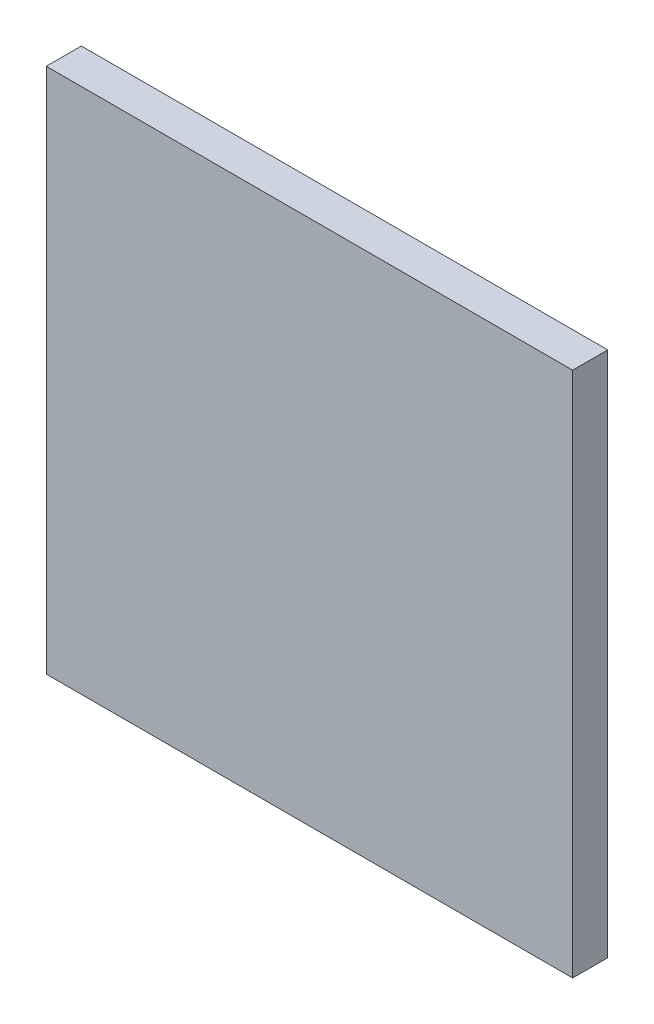
ISO-10303-21;
HEADER;
FILE_DESCRIPTION(('STEP AP214'),'2;1');
FILE_NAME('part.step','',(''),(''),'','','');
FILE_SCHEMA(('AUTOMOTIVE_DESIGN { 1 0 10303 214 1 1 1 1 }'));
ENDSEC;
DATA;
#1=APPLICATION_CONTEXT('core data for automotive mechanical design processes');
#2=APPLICATION_PROTOCOL_DEFINITION('international standard','automotive_design',2000,#1);
#3=PRODUCT_CONTEXT('',#1,'mechanical');
#4=PRODUCT('Part','Part','',(#3));
#5=PRODUCT_RELATED_PRODUCT_CATEGORY('part','',(#4));
#6=PRODUCT_DEFINITION_FORMATION('','',#4);
#7=PRODUCT_DEFINITION_CONTEXT('part definition',#1,'design');
#8=PRODUCT_DEFINITION('design','',#6,#7);
#9=PRODUCT_DEFINITION_SHAPE('','',#8);
#10=(LENGTH_UNIT() NAMED_UNIT(*) SI_UNIT(.MILLI.,.METRE.));
#11=(NAMED_UNIT(*) PLANE_ANGLE_UNIT() SI_UNIT($,.RADIAN.));
#12=(NAMED_UNIT(*) SI_UNIT($,.STERADIAN.) SOLID_ANGLE_UNIT());
#13=UNCERTAINTY_MEASURE_WITH_UNIT(LENGTH_MEASURE(1.E-05),#10,'distance_accuracy_value','');
#14=(GEOMETRIC_REPRESENTATION_CONTEXT(3) GLOBAL_UNCERTAINTY_ASSIGNED_CONTEXT((#13)) GLOBAL_UNIT_ASSIGNED_CONTEXT((#10,
#11,#12)) REPRESENTATION_CONTEXT('',''));
#15=CARTESIAN_POINT('',(0.,0.,0.));
#16=DIRECTION('',(0.,0.,1.));
#17=DIRECTION('',(1.,0.,0.));
#18=AXIS2_PLACEMENT_3D('',#15,#16,#17);
#19=CARTESIAN_POINT('',(74.8235294117647,75.,10.));
#20=DIRECTION('',(0.,-1.,0.));
#21=DIRECTION('',(0.,0.,-1.));
#22=AXIS2_PLACEMENT_3D('',#19,#20,#21);
#23=PLANE('',#22);
#24=DIRECTION('',(-1.,0.,0.));
#25=VECTOR('',#24,1.);
#26=CARTESIAN_POINT('',(74.8235294117647,75.,0.));
#27=LINE('',#26,#25);
#28=CARTESIAN_POINT('',(74.8235294117647,75.,0.));
#29=VERTEX_POINT('',#28);
#30=CARTESIAN_POINT('',(-75.1764705882353,75.,0.));
#31=VERTEX_POINT('',#30);
#32=EDGE_CURVE('E100',#29,#31,#27,.T.);
#33=ORIENTED_EDGE('',*,*,#32,.T.);
#34=DIRECTION('',(0.,0.,-1.));
#35=VECTOR('',#34,1.);
#36=CARTESIAN_POINT('',(-75.1764705882353,75.,10.));
#37=LINE('',#36,#35);
#38=CARTESIAN_POINT('',(-75.1764705882353,75.,10.));
#39=VERTEX_POINT('',#38);
#40=EDGE_CURVE('E11',#39,#31,#37,.T.);
#41=ORIENTED_EDGE('',*,*,#40,.F.);
#42=DIRECTION('',(-1.,0.,0.));
#43=VECTOR('',#42,1.);
#44=CARTESIAN_POINT('',(74.8235294117647,75.,10.));
#45=LINE('',#44,#43);
#46=CARTESIAN_POINT('',(74.8235294117647,75.,10.));
#47=VERTEX_POINT('',#46);
#48=EDGE_CURVE('E77',#47,#39,#45,.T.);
#49=ORIENTED_EDGE('',*,*,#48,.F.);
#50=DIRECTION('',(0.,0.,-1.));
#51=VECTOR('',#50,1.);
#52=CARTESIAN_POINT('',(74.8235294117647,75.,10.));
#53=LINE('',#52,#51);
#54=EDGE_CURVE('E96',#47,#29,#53,.T.);
#55=ORIENTED_EDGE('',*,*,#54,.T.);
#56=EDGE_LOOP('',(#33,#41,#49,#55));
#57=FACE_BOUND('',#56,.T.);
#58=ADVANCED_FACE('F38',(#57),#23,.F.);
#59=CARTESIAN_POINT('',(-75.1764705882353,-75.,10.));
#60=DIRECTION('',(-1.,0.,0.));
#61=DIRECTION('',(0.,0.,1.));
#62=AXIS2_PLACEMENT_3D('',#59,#60,#61);
#63=PLANE('',#62);
#64=DIRECTION('',(0.,1.,0.));
#65=VECTOR('',#64,1.);
#66=CARTESIAN_POINT('',(-75.1764705882353,-75.,0.));
#67=LINE('',#66,#65);
#68=CARTESIAN_POINT('',(-75.1764705882353,-75.,0.));
#69=VERTEX_POINT('',#68);
#70=EDGE_CURVE('E86',#69,#31,#67,.T.);
#71=ORIENTED_EDGE('',*,*,#70,.F.);
#72=DIRECTION('',(0.,0.,-1.));
#73=VECTOR('',#72,1.);
#74=CARTESIAN_POINT('',(-75.1764705882353,-75.,10.));
#75=LINE('',#74,#73);
#76=CARTESIAN_POINT('',(-75.1764705882353,-75.,10.));
#77=VERTEX_POINT('',#76);
#78=EDGE_CURVE('E46',#77,#69,#75,.T.);
#79=ORIENTED_EDGE('',*,*,#78,.F.);
#80=DIRECTION('',(0.,1.,0.));
#81=VECTOR('',#80,1.);
#82=CARTESIAN_POINT('',(-75.1764705882353,-75.,10.));
#83=LINE('',#82,#81);
#84=EDGE_CURVE('E84',#77,#39,#83,.T.);
#85=ORIENTED_EDGE('',*,*,#84,.T.);
#86=ORIENTED_EDGE('',*,*,#40,.T.);
#87=EDGE_LOOP('',(#71,#79,#85,#86));
#88=FACE_BOUND('',#87,.T.);
#89=ADVANCED_FACE('F83',(#88),#63,.T.);
#90=CARTESIAN_POINT('',(74.8235294117647,-75.,10.));
#91=DIRECTION('',(0.,-1.,0.));
#92=DIRECTION('',(1.,0.,0.));
#93=AXIS2_PLACEMENT_3D('',#90,#91,#92);
#94=PLANE('',#93);
#95=DIRECTION('',(-1.,0.,0.));
#96=VECTOR('',#95,1.);
#97=CARTESIAN_POINT('',(74.8235294117647,-75.,0.));
#98=LINE('',#97,#96);
#99=CARTESIAN_POINT('',(74.8235294117647,-75.,0.));
#100=VERTEX_POINT('',#99);
#101=EDGE_CURVE('E104',#100,#69,#98,.T.);
#102=ORIENTED_EDGE('',*,*,#101,.F.);
#103=DIRECTION('',(0.,0.,-1.));
#104=VECTOR('',#103,1.);
#105=CARTESIAN_POINT('',(74.8235294117647,-75.,10.));
#106=LINE('',#105,#104);
#107=CARTESIAN_POINT('',(74.8235294117647,-75.,10.));
#108=VERTEX_POINT('',#107);
#109=EDGE_CURVE('E69',#108,#100,#106,.T.);
#110=ORIENTED_EDGE('',*,*,#109,.F.);
#111=DIRECTION('',(-1.,0.,0.));
#112=VECTOR('',#111,1.);
#113=CARTESIAN_POINT('',(74.8235294117647,-75.,10.));
#114=LINE('',#113,#112);
#115=EDGE_CURVE('E92',#108,#77,#114,.T.);
#116=ORIENTED_EDGE('',*,*,#115,.T.);
#117=ORIENTED_EDGE('',*,*,#78,.T.);
#118=EDGE_LOOP('',(#102,#110,#116,#117));
#119=FACE_BOUND('',#118,.T.);
#120=ADVANCED_FACE('F94',(#119),#94,.T.);
#121=CARTESIAN_POINT('',(74.8235294117647,-75.,10.));
#122=DIRECTION('',(-1.,0.,0.));
#123=DIRECTION('',(0.,0.,1.));
#124=AXIS2_PLACEMENT_3D('',#121,#122,#123);
#125=PLANE('',#124);
#126=DIRECTION('',(0.,1.,0.));
#127=VECTOR('',#126,1.);
#128=CARTESIAN_POINT('',(74.8235294117647,-75.,0.));
#129=LINE('',#128,#127);
#130=EDGE_CURVE('E72',#100,#29,#129,.T.);
#131=ORIENTED_EDGE('',*,*,#130,.T.);
#132=ORIENTED_EDGE('',*,*,#54,.F.);
#133=DIRECTION('',(0.,1.,0.));
#134=VECTOR('',#133,1.);
#135=CARTESIAN_POINT('',(74.8235294117647,-75.,10.));
#136=LINE('',#135,#134);
#137=EDGE_CURVE('E54',#108,#47,#136,.T.);
#138=ORIENTED_EDGE('',*,*,#137,.F.);
#139=ORIENTED_EDGE('',*,*,#109,.T.);
#140=EDGE_LOOP('',(#131,#132,#138,#139));
#141=FACE_BOUND('',#140,.T.);
#142=ADVANCED_FACE('F117',(#141),#125,.F.);
#143=CARTESIAN_POINT('',(0.,0.,10.));
#144=DIRECTION('',(0.,0.,-1.));
#145=DIRECTION('',(-1.,0.,0.));
#146=AXIS2_PLACEMENT_3D('',#143,#144,#145);
#147=PLANE('',#146);
#148=ORIENTED_EDGE('',*,*,#48,.T.);
#149=ORIENTED_EDGE('',*,*,#84,.F.);
#150=ORIENTED_EDGE('',*,*,#115,.F.);
#151=ORIENTED_EDGE('',*,*,#137,.T.);
#152=EDGE_LOOP('',(#148,#149,#150,#151));
#153=FACE_BOUND('',#152,.T.);
#154=ADVANCED_FACE('F91',(#153),#147,.F.);
#155=CARTESIAN_POINT('',(0.,0.,0.));
#156=DIRECTION('',(0.,0.,-1.));
#157=DIRECTION('',(-1.,0.,0.));
#158=AXIS2_PLACEMENT_3D('',#155,#156,#157);
#159=PLANE('',#158);
#160=ORIENTED_EDGE('',*,*,#32,.F.);
#161=ORIENTED_EDGE('',*,*,#130,.F.);
#162=ORIENTED_EDGE('',*,*,#101,.T.);
#163=ORIENTED_EDGE('',*,*,#70,.T.);
#164=EDGE_LOOP('',(#160,#161,#162,#163));
#165=FACE_BOUND('',#164,.T.);
#166=ADVANCED_FACE('F111',(#165),#159,.T.);
#167=CLOSED_SHELL('',(#58,#89,#120,#142,#154,#166));
#168=MANIFOLD_SOLID_BREP('B2',#167);
#169=ADVANCED_BREP_SHAPE_REPRESENTATION('',(#18,#168),#14);
#170=SHAPE_DEFINITION_REPRESENTATION(#9,#169);
ENDSEC;
END-ISO-10303-21;
